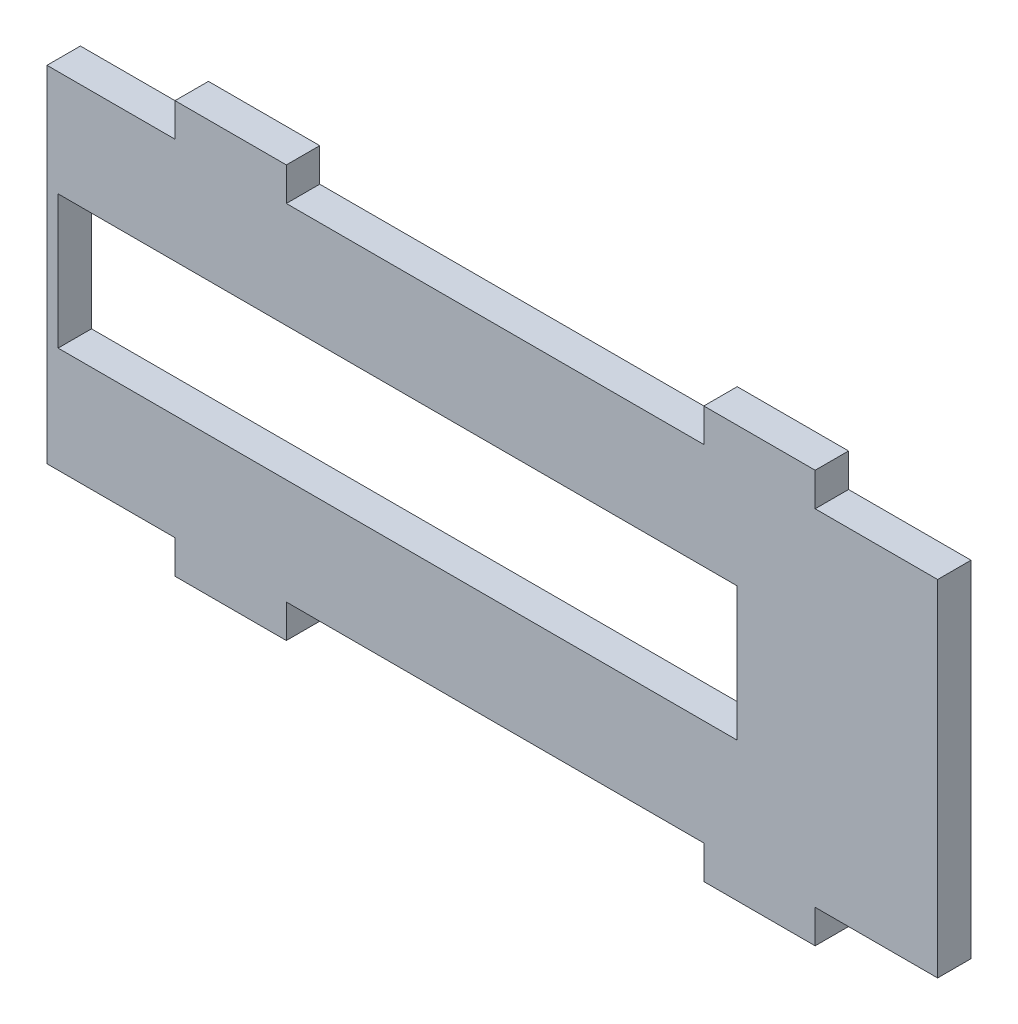
ISO-10303-21;
HEADER;
FILE_DESCRIPTION(('STEP AP214'),'2;1');
FILE_NAME('part.step','',(''),(''),'','','');
FILE_SCHEMA(('AUTOMOTIVE_DESIGN { 1 0 10303 214 1 1 1 1 }'));
ENDSEC;
DATA;
#1=APPLICATION_CONTEXT('core data for automotive mechanical design processes');
#2=APPLICATION_PROTOCOL_DEFINITION('international standard','automotive_design',2000,#1);
#3=PRODUCT_CONTEXT('',#1,'mechanical');
#4=PRODUCT('Part','Part','',(#3));
#5=PRODUCT_RELATED_PRODUCT_CATEGORY('part','',(#4));
#6=PRODUCT_DEFINITION_FORMATION('','',#4);
#7=PRODUCT_DEFINITION_CONTEXT('part definition',#1,'design');
#8=PRODUCT_DEFINITION('design','',#6,#7);
#9=PRODUCT_DEFINITION_SHAPE('','',#8);
#10=(LENGTH_UNIT() NAMED_UNIT(*) SI_UNIT(.MILLI.,.METRE.));
#11=(NAMED_UNIT(*) PLANE_ANGLE_UNIT() SI_UNIT($,.RADIAN.));
#12=(NAMED_UNIT(*) SI_UNIT($,.STERADIAN.) SOLID_ANGLE_UNIT());
#13=UNCERTAINTY_MEASURE_WITH_UNIT(LENGTH_MEASURE(1.E-05),#10,'distance_accuracy_value','');
#14=(GEOMETRIC_REPRESENTATION_CONTEXT(3) GLOBAL_UNCERTAINTY_ASSIGNED_CONTEXT((#13)) GLOBAL_UNIT_ASSIGNED_CONTEXT((#10,
#11,#12)) REPRESENTATION_CONTEXT('',''));
#15=CARTESIAN_POINT('',(0.,0.,0.));
#16=DIRECTION('',(0.,0.,1.));
#17=DIRECTION('',(1.,0.,0.));
#18=AXIS2_PLACEMENT_3D('',#15,#16,#17);
#19=CARTESIAN_POINT('',(0.,0.,3.));
#20=DIRECTION('',(0.,1.,0.));
#21=DIRECTION('',(0.,0.,1.));
#22=AXIS2_PLACEMENT_3D('',#19,#20,#21);
#23=PLANE('',#22);
#24=DIRECTION('',(1.,0.,0.));
#25=VECTOR('',#24,1.);
#26=CARTESIAN_POINT('',(0.,0.,3.));
#27=LINE('',#26,#25);
#28=CARTESIAN_POINT('',(21.5,0.,3.));
#29=VERTEX_POINT('',#28);
#30=CARTESIAN_POINT('',(59.,0.,3.));
#31=VERTEX_POINT('',#30);
#32=EDGE_CURVE('E55',#29,#31,#27,.T.);
#33=ORIENTED_EDGE('',*,*,#32,.F.);
#34=DIRECTION('',(0.,0.,1.));
#35=VECTOR('',#34,1.);
#36=CARTESIAN_POINT('',(21.5,0.,0.));
#37=LINE('',#36,#35);
#38=CARTESIAN_POINT('',(21.5,0.,0.));
#39=VERTEX_POINT('',#38);
#40=EDGE_CURVE('E355',#39,#29,#37,.T.);
#41=ORIENTED_EDGE('',*,*,#40,.F.);
#42=DIRECTION('',(1.,0.,0.));
#43=VECTOR('',#42,1.);
#44=CARTESIAN_POINT('',(0.,0.,0.));
#45=LINE('',#44,#43);
#46=CARTESIAN_POINT('',(59.,0.,0.));
#47=VERTEX_POINT('',#46);
#48=EDGE_CURVE('E223',#39,#47,#45,.T.);
#49=ORIENTED_EDGE('',*,*,#48,.T.);
#50=DIRECTION('',(0.,0.,1.));
#51=VECTOR('',#50,1.);
#52=CARTESIAN_POINT('',(59.,0.,0.));
#53=LINE('',#52,#51);
#54=EDGE_CURVE('E339',#47,#31,#53,.T.);
#55=ORIENTED_EDGE('',*,*,#54,.T.);
#56=EDGE_LOOP('',(#33,#41,#49,#55));
#57=FACE_BOUND('',#56,.T.);
#58=ADVANCED_FACE('F35',(#57),#23,.F.);
#59=DIRECTION('',(0.,0.,1.));
#60=VECTOR('',#59,1.);
#61=CARTESIAN_POINT('',(69.,0.,0.));
#62=LINE('',#61,#60);
#63=CARTESIAN_POINT('',(69.,0.,0.));
#64=VERTEX_POINT('',#63);
#65=CARTESIAN_POINT('',(69.,0.,3.));
#66=VERTEX_POINT('',#65);
#67=EDGE_CURVE('E337',#64,#66,#62,.T.);
#68=ORIENTED_EDGE('',*,*,#67,.F.);
#69=CARTESIAN_POINT('',(80.,0.,0.));
#70=VERTEX_POINT('',#69);
#71=EDGE_CURVE('E225',#64,#70,#45,.T.);
#72=ORIENTED_EDGE('',*,*,#71,.T.);
#73=DIRECTION('',(0.,0.,-1.));
#74=VECTOR('',#73,1.);
#75=CARTESIAN_POINT('',(80.,0.,3.));
#76=LINE('',#75,#74);
#77=CARTESIAN_POINT('',(80.,0.,3.));
#78=VERTEX_POINT('',#77);
#79=EDGE_CURVE('E43',#78,#70,#76,.T.);
#80=ORIENTED_EDGE('',*,*,#79,.F.);
#81=EDGE_CURVE('E252',#66,#78,#27,.T.);
#82=ORIENTED_EDGE('',*,*,#81,.F.);
#83=EDGE_LOOP('',(#68,#72,#80,#82));
#84=FACE_BOUND('',#83,.T.);
#85=ADVANCED_FACE('F387',(#84),#23,.F.);
#86=CARTESIAN_POINT('',(0.,31.,3.));
#87=DIRECTION('',(0.,-1.,0.));
#88=DIRECTION('',(0.,0.,-1.));
#89=AXIS2_PLACEMENT_3D('',#86,#87,#88);
#90=PLANE('',#89);
#91=DIRECTION('',(-1.,0.,0.));
#92=VECTOR('',#91,1.);
#93=CARTESIAN_POINT('',(0.,31.,3.));
#94=LINE('',#93,#92);
#95=CARTESIAN_POINT('',(59.,31.,3.));
#96=VERTEX_POINT('',#95);
#97=CARTESIAN_POINT('',(21.5,31.,3.));
#98=VERTEX_POINT('',#97);
#99=EDGE_CURVE('E246',#96,#98,#94,.T.);
#100=ORIENTED_EDGE('',*,*,#99,.F.);
#101=DIRECTION('',(0.,0.,1.));
#102=VECTOR('',#101,1.);
#103=CARTESIAN_POINT('',(59.,31.,0.));
#104=LINE('',#103,#102);
#105=CARTESIAN_POINT('',(59.,31.,0.));
#106=VERTEX_POINT('',#105);
#107=EDGE_CURVE('E304',#106,#96,#104,.T.);
#108=ORIENTED_EDGE('',*,*,#107,.F.);
#109=DIRECTION('',(-1.,0.,0.));
#110=VECTOR('',#109,1.);
#111=CARTESIAN_POINT('',(0.,31.,0.));
#112=LINE('',#111,#110);
#113=CARTESIAN_POINT('',(21.5,31.,0.));
#114=VERTEX_POINT('',#113);
#115=EDGE_CURVE('E421',#106,#114,#112,.T.);
#116=ORIENTED_EDGE('',*,*,#115,.T.);
#117=DIRECTION('',(0.,0.,1.));
#118=VECTOR('',#117,1.);
#119=CARTESIAN_POINT('',(21.5,31.,0.));
#120=LINE('',#119,#118);
#121=EDGE_CURVE('E287',#114,#98,#120,.T.);
#122=ORIENTED_EDGE('',*,*,#121,.T.);
#123=EDGE_LOOP('',(#100,#108,#116,#122));
#124=FACE_BOUND('',#123,.T.);
#125=ADVANCED_FACE('F419',(#124),#90,.F.);
#126=DIRECTION('',(0.,0.,1.));
#127=VECTOR('',#126,1.);
#128=CARTESIAN_POINT('',(11.5,31.,0.));
#129=LINE('',#128,#127);
#130=CARTESIAN_POINT('',(11.5,31.,0.));
#131=VERTEX_POINT('',#130);
#132=CARTESIAN_POINT('',(11.5,31.,3.));
#133=VERTEX_POINT('',#132);
#134=EDGE_CURVE('E285',#131,#133,#129,.T.);
#135=ORIENTED_EDGE('',*,*,#134,.F.);
#136=CARTESIAN_POINT('',(0.,31.,0.));
#137=VERTEX_POINT('',#136);
#138=EDGE_CURVE('E226',#131,#137,#112,.T.);
#139=ORIENTED_EDGE('',*,*,#138,.T.);
#140=DIRECTION('',(0.,0.,-1.));
#141=VECTOR('',#140,1.);
#142=CARTESIAN_POINT('',(0.,31.,3.));
#143=LINE('',#142,#141);
#144=CARTESIAN_POINT('',(0.,31.,3.));
#145=VERTEX_POINT('',#144);
#146=EDGE_CURVE('E245',#145,#137,#143,.T.);
#147=ORIENTED_EDGE('',*,*,#146,.F.);
#148=EDGE_CURVE('E247',#133,#145,#94,.T.);
#149=ORIENTED_EDGE('',*,*,#148,.F.);
#150=EDGE_LOOP('',(#135,#139,#147,#149));
#151=FACE_BOUND('',#150,.T.);
#152=ADVANCED_FACE('F432',(#151),#90,.F.);
#153=CARTESIAN_POINT('',(0.,0.,3.));
#154=DIRECTION('',(0.,0.,-1.));
#155=DIRECTION('',(-1.,0.,0.));
#156=AXIS2_PLACEMENT_3D('',#153,#154,#155);
#157=PLANE('',#156);
#158=DIRECTION('',(0.,-1.,0.));
#159=VECTOR('',#158,1.);
#160=CARTESIAN_POINT('',(0.,0.,3.));
#161=LINE('',#160,#159);
#162=CARTESIAN_POINT('',(0.,0.,3.));
#163=VERTEX_POINT('',#162);
#164=EDGE_CURVE('E253',#145,#163,#161,.T.);
#165=ORIENTED_EDGE('',*,*,#164,.T.);
#166=CARTESIAN_POINT('',(11.5,0.,3.));
#167=VERTEX_POINT('',#166);
#168=EDGE_CURVE('E250',#163,#167,#27,.T.);
#169=ORIENTED_EDGE('',*,*,#168,.T.);
#170=DIRECTION('',(0.,-1.,0.));
#171=VECTOR('',#170,1.);
#172=CARTESIAN_POINT('',(11.5,0.,3.));
#173=LINE('',#172,#171);
#174=CARTESIAN_POINT('',(11.5,-3.00000000000002,3.));
#175=VERTEX_POINT('',#174);
#176=EDGE_CURVE('E202',#167,#175,#173,.T.);
#177=ORIENTED_EDGE('',*,*,#176,.T.);
#178=DIRECTION('',(1.,0.,0.));
#179=VECTOR('',#178,1.);
#180=CARTESIAN_POINT('',(11.5,-3.00000000000002,3.));
#181=LINE('',#180,#179);
#182=CARTESIAN_POINT('',(21.5,-3.00000000000001,3.));
#183=VERTEX_POINT('',#182);
#184=EDGE_CURVE('E367',#175,#183,#181,.T.);
#185=ORIENTED_EDGE('',*,*,#184,.T.);
#186=DIRECTION('',(0.,1.,0.));
#187=VECTOR('',#186,1.);
#188=CARTESIAN_POINT('',(21.5,0.,3.));
#189=LINE('',#188,#187);
#190=EDGE_CURVE('E50',#183,#29,#189,.T.);
#191=ORIENTED_EDGE('',*,*,#190,.T.);
#192=ORIENTED_EDGE('',*,*,#32,.T.);
#193=DIRECTION('',(0.,-1.,0.));
#194=VECTOR('',#193,1.);
#195=CARTESIAN_POINT('',(59.,0.,3.));
#196=LINE('',#195,#194);
#197=CARTESIAN_POINT('',(59.,-3.00000000000001,3.));
#198=VERTEX_POINT('',#197);
#199=EDGE_CURVE('E350',#31,#198,#196,.T.);
#200=ORIENTED_EDGE('',*,*,#199,.T.);
#201=DIRECTION('',(1.,0.,0.));
#202=VECTOR('',#201,1.);
#203=CARTESIAN_POINT('',(69.,-3.00000000000001,3.));
#204=LINE('',#203,#202);
#205=CARTESIAN_POINT('',(69.,-3.00000000000001,3.));
#206=VERTEX_POINT('',#205);
#207=EDGE_CURVE('E346',#198,#206,#204,.T.);
#208=ORIENTED_EDGE('',*,*,#207,.T.);
#209=DIRECTION('',(0.,1.,0.));
#210=VECTOR('',#209,1.);
#211=CARTESIAN_POINT('',(69.,0.,3.));
#212=LINE('',#211,#210);
#213=EDGE_CURVE('E352',#206,#66,#212,.T.);
#214=ORIENTED_EDGE('',*,*,#213,.T.);
#215=ORIENTED_EDGE('',*,*,#81,.T.);
#216=DIRECTION('',(0.,1.,0.));
#217=VECTOR('',#216,1.);
#218=CARTESIAN_POINT('',(80.,0.,3.));
#219=LINE('',#218,#217);
#220=CARTESIAN_POINT('',(80.,31.,3.));
#221=VERTEX_POINT('',#220);
#222=EDGE_CURVE('E248',#78,#221,#219,.T.);
#223=ORIENTED_EDGE('',*,*,#222,.T.);
#224=CARTESIAN_POINT('',(69.,31.,3.));
#225=VERTEX_POINT('',#224);
#226=EDGE_CURVE('E242',#221,#225,#94,.T.);
#227=ORIENTED_EDGE('',*,*,#226,.T.);
#228=DIRECTION('',(0.,1.,0.));
#229=VECTOR('',#228,1.);
#230=CARTESIAN_POINT('',(69.,31.,3.));
#231=LINE('',#230,#229);
#232=CARTESIAN_POINT('',(69.,34.,3.));
#233=VERTEX_POINT('',#232);
#234=EDGE_CURVE('E327',#225,#233,#231,.T.);
#235=ORIENTED_EDGE('',*,*,#234,.T.);
#236=DIRECTION('',(-1.,0.,0.));
#237=VECTOR('',#236,1.);
#238=CARTESIAN_POINT('',(69.,34.,3.));
#239=LINE('',#238,#237);
#240=CARTESIAN_POINT('',(59.,34.,3.));
#241=VERTEX_POINT('',#240);
#242=EDGE_CURVE('E324',#233,#241,#239,.T.);
#243=ORIENTED_EDGE('',*,*,#242,.T.);
#244=DIRECTION('',(0.,-1.,0.));
#245=VECTOR('',#244,1.);
#246=CARTESIAN_POINT('',(59.,31.,3.));
#247=LINE('',#246,#245);
#248=EDGE_CURVE('E321',#241,#96,#247,.T.);
#249=ORIENTED_EDGE('',*,*,#248,.T.);
#250=ORIENTED_EDGE('',*,*,#99,.T.);
#251=DIRECTION('',(0.,1.,0.));
#252=VECTOR('',#251,1.);
#253=CARTESIAN_POINT('',(21.5,31.,3.));
#254=LINE('',#253,#252);
#255=CARTESIAN_POINT('',(21.5,34.,3.));
#256=VERTEX_POINT('',#255);
#257=EDGE_CURVE('E298',#98,#256,#254,.T.);
#258=ORIENTED_EDGE('',*,*,#257,.T.);
#259=DIRECTION('',(-1.,0.,0.));
#260=VECTOR('',#259,1.);
#261=CARTESIAN_POINT('',(11.5,34.,3.));
#262=LINE('',#261,#260);
#263=CARTESIAN_POINT('',(11.5,34.,3.));
#264=VERTEX_POINT('',#263);
#265=EDGE_CURVE('E294',#256,#264,#262,.T.);
#266=ORIENTED_EDGE('',*,*,#265,.T.);
#267=DIRECTION('',(0.,-1.,0.));
#268=VECTOR('',#267,1.);
#269=CARTESIAN_POINT('',(11.5,31.,3.));
#270=LINE('',#269,#268);
#271=EDGE_CURVE('E301',#264,#133,#270,.T.);
#272=ORIENTED_EDGE('',*,*,#271,.T.);
#273=ORIENTED_EDGE('',*,*,#148,.T.);
#274=EDGE_LOOP('',(#165,#169,#177,#185,#191,#192,#200,#208,#214,#215,#223,#227,#235,#243,#249,
#250,#258,#266,#272,#273));
#275=FACE_BOUND('',#274,.T.);
#276=DIRECTION('',(0.,-1.,0.));
#277=VECTOR('',#276,1.);
#278=CARTESIAN_POINT('',(0.999999999999999,21.5,3.));
#279=LINE('',#278,#277);
#280=CARTESIAN_POINT('',(0.999999999999999,21.5,3.));
#281=VERTEX_POINT('',#280);
#282=CARTESIAN_POINT('',(0.999999999999999,9.5,3.));
#283=VERTEX_POINT('',#282);
#284=EDGE_CURVE('E267',#281,#283,#279,.T.);
#285=ORIENTED_EDGE('',*,*,#284,.F.);
#286=DIRECTION('',(-1.,0.,0.));
#287=VECTOR('',#286,1.);
#288=CARTESIAN_POINT('',(0.999999999999999,21.5,3.));
#289=LINE('',#288,#287);
#290=CARTESIAN_POINT('',(62.,21.5,3.));
#291=VERTEX_POINT('',#290);
#292=EDGE_CURVE('E263',#291,#281,#289,.T.);
#293=ORIENTED_EDGE('',*,*,#292,.F.);
#294=DIRECTION('',(0.,1.,0.));
#295=VECTOR('',#294,1.);
#296=CARTESIAN_POINT('',(62.,21.5,3.));
#297=LINE('',#296,#295);
#298=CARTESIAN_POINT('',(62.,9.5,3.));
#299=VERTEX_POINT('',#298);
#300=EDGE_CURVE('E279',#299,#291,#297,.T.);
#301=ORIENTED_EDGE('',*,*,#300,.F.);
#302=DIRECTION('',(1.,0.,0.));
#303=VECTOR('',#302,1.);
#304=CARTESIAN_POINT('',(0.999999999999999,9.5,3.));
#305=LINE('',#304,#303);
#306=EDGE_CURVE('E282',#283,#299,#305,.T.);
#307=ORIENTED_EDGE('',*,*,#306,.F.);
#308=EDGE_LOOP('',(#285,#293,#301,#307));
#309=FACE_BOUND('',#308,.T.);
#310=ADVANCED_FACE('F382',(#275,#309),#157,.F.);
#311=CARTESIAN_POINT('',(0.,0.,0.));
#312=DIRECTION('',(0.,0.,-1.));
#313=DIRECTION('',(-1.,0.,0.));
#314=AXIS2_PLACEMENT_3D('',#311,#312,#313);
#315=PLANE('',#314);
#316=DIRECTION('',(0.,-1.,0.));
#317=VECTOR('',#316,1.);
#318=CARTESIAN_POINT('',(0.,0.,0.));
#319=LINE('',#318,#317);
#320=CARTESIAN_POINT('',(0.,0.,0.));
#321=VERTEX_POINT('',#320);
#322=EDGE_CURVE('E229',#137,#321,#319,.T.);
#323=ORIENTED_EDGE('',*,*,#322,.F.);
#324=ORIENTED_EDGE('',*,*,#138,.F.);
#325=DIRECTION('',(0.,-1.,0.));
#326=VECTOR('',#325,1.);
#327=CARTESIAN_POINT('',(11.5,31.,0.));
#328=LINE('',#327,#326);
#329=CARTESIAN_POINT('',(11.5,34.,0.));
#330=VERTEX_POINT('',#329);
#331=EDGE_CURVE('E297',#330,#131,#328,.T.);
#332=ORIENTED_EDGE('',*,*,#331,.F.);
#333=DIRECTION('',(-1.,0.,0.));
#334=VECTOR('',#333,1.);
#335=CARTESIAN_POINT('',(11.5,34.,0.));
#336=LINE('',#335,#334);
#337=CARTESIAN_POINT('',(21.5,34.,0.));
#338=VERTEX_POINT('',#337);
#339=EDGE_CURVE('E288',#338,#330,#336,.T.);
#340=ORIENTED_EDGE('',*,*,#339,.F.);
#341=DIRECTION('',(0.,1.,0.));
#342=VECTOR('',#341,1.);
#343=CARTESIAN_POINT('',(21.5,31.,0.));
#344=LINE('',#343,#342);
#345=EDGE_CURVE('E307',#114,#338,#344,.T.);
#346=ORIENTED_EDGE('',*,*,#345,.F.);
#347=ORIENTED_EDGE('',*,*,#115,.F.);
#348=DIRECTION('',(0.,-1.,0.));
#349=VECTOR('',#348,1.);
#350=CARTESIAN_POINT('',(59.,31.,0.));
#351=LINE('',#350,#349);
#352=CARTESIAN_POINT('',(59.,34.,0.));
#353=VERTEX_POINT('',#352);
#354=EDGE_CURVE('E315',#353,#106,#351,.T.);
#355=ORIENTED_EDGE('',*,*,#354,.F.);
#356=DIRECTION('',(-1.,0.,0.));
#357=VECTOR('',#356,1.);
#358=CARTESIAN_POINT('',(69.,34.,0.));
#359=LINE('',#358,#357);
#360=CARTESIAN_POINT('',(69.,34.,0.));
#361=VERTEX_POINT('',#360);
#362=EDGE_CURVE('E332',#361,#353,#359,.T.);
#363=ORIENTED_EDGE('',*,*,#362,.F.);
#364=DIRECTION('',(0.,1.,0.));
#365=VECTOR('',#364,1.);
#366=CARTESIAN_POINT('',(69.,31.,0.));
#367=LINE('',#366,#365);
#368=CARTESIAN_POINT('',(69.,31.,0.));
#369=VERTEX_POINT('',#368);
#370=EDGE_CURVE('E323',#369,#361,#367,.T.);
#371=ORIENTED_EDGE('',*,*,#370,.F.);
#372=CARTESIAN_POINT('',(80.,31.,0.));
#373=VERTEX_POINT('',#372);
#374=EDGE_CURVE('E255',#373,#369,#112,.T.);
#375=ORIENTED_EDGE('',*,*,#374,.F.);
#376=DIRECTION('',(0.,1.,0.));
#377=VECTOR('',#376,1.);
#378=CARTESIAN_POINT('',(80.,0.,0.));
#379=LINE('',#378,#377);
#380=EDGE_CURVE('E222',#70,#373,#379,.T.);
#381=ORIENTED_EDGE('',*,*,#380,.F.);
#382=ORIENTED_EDGE('',*,*,#71,.F.);
#383=DIRECTION('',(0.,1.,0.));
#384=VECTOR('',#383,1.);
#385=CARTESIAN_POINT('',(69.,0.,0.));
#386=LINE('',#385,#384);
#387=CARTESIAN_POINT('',(69.,-3.00000000000001,0.));
#388=VERTEX_POINT('',#387);
#389=EDGE_CURVE('E349',#388,#64,#386,.T.);
#390=ORIENTED_EDGE('',*,*,#389,.F.);
#391=DIRECTION('',(1.,0.,0.));
#392=VECTOR('',#391,1.);
#393=CARTESIAN_POINT('',(69.,-3.00000000000001,0.));
#394=LINE('',#393,#392);
#395=CARTESIAN_POINT('',(59.,-3.00000000000001,0.));
#396=VERTEX_POINT('',#395);
#397=EDGE_CURVE('E340',#396,#388,#394,.T.);
#398=ORIENTED_EDGE('',*,*,#397,.F.);
#399=DIRECTION('',(0.,-1.,0.));
#400=VECTOR('',#399,1.);
#401=CARTESIAN_POINT('',(59.,0.,0.));
#402=LINE('',#401,#400);
#403=EDGE_CURVE('E358',#47,#396,#402,.T.);
#404=ORIENTED_EDGE('',*,*,#403,.F.);
#405=ORIENTED_EDGE('',*,*,#48,.F.);
#406=DIRECTION('',(0.,1.,0.));
#407=VECTOR('',#406,1.);
#408=CARTESIAN_POINT('',(21.5,0.,0.));
#409=LINE('',#408,#407);
#410=CARTESIAN_POINT('',(21.5,-3.00000000000001,0.));
#411=VERTEX_POINT('',#410);
#412=EDGE_CURVE('E207',#411,#39,#409,.T.);
#413=ORIENTED_EDGE('',*,*,#412,.F.);
#414=DIRECTION('',(1.,0.,0.));
#415=VECTOR('',#414,1.);
#416=CARTESIAN_POINT('',(11.5,-3.00000000000002,0.));
#417=LINE('',#416,#415);
#418=CARTESIAN_POINT('',(11.5,-3.00000000000002,0.));
#419=VERTEX_POINT('',#418);
#420=EDGE_CURVE('E217',#419,#411,#417,.T.);
#421=ORIENTED_EDGE('',*,*,#420,.F.);
#422=DIRECTION('',(0.,-1.,0.));
#423=VECTOR('',#422,1.);
#424=CARTESIAN_POINT('',(11.5,0.,0.));
#425=LINE('',#424,#423);
#426=CARTESIAN_POINT('',(11.5,0.,0.));
#427=VERTEX_POINT('',#426);
#428=EDGE_CURVE('E200',#427,#419,#425,.T.);
#429=ORIENTED_EDGE('',*,*,#428,.F.);
#430=EDGE_CURVE('E214',#321,#427,#45,.T.);
#431=ORIENTED_EDGE('',*,*,#430,.F.);
#432=EDGE_LOOP('',(#323,#324,#332,#340,#346,#347,#355,#363,#371,#375,#381,#382,#390,#398,#404,
#405,#413,#421,#429,#431));
#433=FACE_BOUND('',#432,.T.);
#434=DIRECTION('',(-1.,0.,0.));
#435=VECTOR('',#434,1.);
#436=CARTESIAN_POINT('',(0.999999999999999,21.5,0.));
#437=LINE('',#436,#435);
#438=CARTESIAN_POINT('',(62.,21.5,0.));
#439=VERTEX_POINT('',#438);
#440=CARTESIAN_POINT('',(0.999999999999999,21.5,0.));
#441=VERTEX_POINT('',#440);
#442=EDGE_CURVE('E264',#439,#441,#437,.T.);
#443=ORIENTED_EDGE('',*,*,#442,.T.);
#444=DIRECTION('',(0.,-1.,0.));
#445=VECTOR('',#444,1.);
#446=CARTESIAN_POINT('',(0.999999999999999,21.5,0.));
#447=LINE('',#446,#445);
#448=CARTESIAN_POINT('',(0.999999999999999,9.5,0.));
#449=VERTEX_POINT('',#448);
#450=EDGE_CURVE('E274',#441,#449,#447,.T.);
#451=ORIENTED_EDGE('',*,*,#450,.T.);
#452=DIRECTION('',(1.,0.,0.));
#453=VECTOR('',#452,1.);
#454=CARTESIAN_POINT('',(0.999999999999999,9.5,0.));
#455=LINE('',#454,#453);
#456=CARTESIAN_POINT('',(62.,9.5,0.));
#457=VERTEX_POINT('',#456);
#458=EDGE_CURVE('E271',#449,#457,#455,.T.);
#459=ORIENTED_EDGE('',*,*,#458,.T.);
#460=DIRECTION('',(0.,1.,0.));
#461=VECTOR('',#460,1.);
#462=CARTESIAN_POINT('',(62.,21.5,0.));
#463=LINE('',#462,#461);
#464=EDGE_CURVE('E268',#457,#439,#463,.T.);
#465=ORIENTED_EDGE('',*,*,#464,.T.);
#466=EDGE_LOOP('',(#443,#451,#459,#465));
#467=FACE_BOUND('',#466,.T.);
#468=ADVANCED_FACE('F212',(#433,#467),#315,.T.);
#469=CARTESIAN_POINT('',(0.,0.,3.));
#470=DIRECTION('',(1.,0.,0.));
#471=DIRECTION('',(0.,0.,-1.));
#472=AXIS2_PLACEMENT_3D('',#469,#470,#471);
#473=PLANE('',#472);
#474=ORIENTED_EDGE('',*,*,#322,.T.);
#475=DIRECTION('',(0.,0.,-1.));
#476=VECTOR('',#475,1.);
#477=CARTESIAN_POINT('',(0.,0.,3.));
#478=LINE('',#477,#476);
#479=EDGE_CURVE('E11',#163,#321,#478,.T.);
#480=ORIENTED_EDGE('',*,*,#479,.F.);
#481=ORIENTED_EDGE('',*,*,#164,.F.);
#482=ORIENTED_EDGE('',*,*,#146,.T.);
#483=EDGE_LOOP('',(#474,#480,#481,#482));
#484=FACE_BOUND('',#483,.T.);
#485=ADVANCED_FACE('F37',(#484),#473,.F.);
#486=ORIENTED_EDGE('',*,*,#430,.T.);
#487=DIRECTION('',(0.,0.,1.));
#488=VECTOR('',#487,1.);
#489=CARTESIAN_POINT('',(11.5,0.,0.));
#490=LINE('',#489,#488);
#491=EDGE_CURVE('E197',#427,#167,#490,.T.);
#492=ORIENTED_EDGE('',*,*,#491,.T.);
#493=ORIENTED_EDGE('',*,*,#168,.F.);
#494=ORIENTED_EDGE('',*,*,#479,.T.);
#495=EDGE_LOOP('',(#486,#492,#493,#494));
#496=FACE_BOUND('',#495,.T.);
#497=ADVANCED_FACE('F219',(#496),#23,.F.);
#498=CARTESIAN_POINT('',(80.,0.,3.));
#499=DIRECTION('',(-1.,0.,0.));
#500=DIRECTION('',(0.,0.,1.));
#501=AXIS2_PLACEMENT_3D('',#498,#499,#500);
#502=PLANE('',#501);
#503=ORIENTED_EDGE('',*,*,#380,.T.);
#504=DIRECTION('',(0.,0.,-1.));
#505=VECTOR('',#504,1.);
#506=CARTESIAN_POINT('',(80.,31.,3.));
#507=LINE('',#506,#505);
#508=EDGE_CURVE('E390',#221,#373,#507,.T.);
#509=ORIENTED_EDGE('',*,*,#508,.F.);
#510=ORIENTED_EDGE('',*,*,#222,.F.);
#511=ORIENTED_EDGE('',*,*,#79,.T.);
#512=EDGE_LOOP('',(#503,#509,#510,#511));
#513=FACE_BOUND('',#512,.T.);
#514=ADVANCED_FACE('F391',(#513),#502,.F.);
#515=ORIENTED_EDGE('',*,*,#374,.T.);
#516=DIRECTION('',(0.,0.,1.));
#517=VECTOR('',#516,1.);
#518=CARTESIAN_POINT('',(69.,31.,0.));
#519=LINE('',#518,#517);
#520=EDGE_CURVE('E311',#369,#225,#519,.T.);
#521=ORIENTED_EDGE('',*,*,#520,.T.);
#522=ORIENTED_EDGE('',*,*,#226,.F.);
#523=ORIENTED_EDGE('',*,*,#508,.T.);
#524=EDGE_LOOP('',(#515,#521,#522,#523));
#525=FACE_BOUND('',#524,.T.);
#526=ADVANCED_FACE('F398',(#525),#90,.F.);
#527=CARTESIAN_POINT('',(0.999999999999999,21.5,3.));
#528=DIRECTION('',(1.,0.,0.));
#529=DIRECTION('',(0.,0.,-1.));
#530=AXIS2_PLACEMENT_3D('',#527,#528,#529);
#531=PLANE('',#530);
#532=ORIENTED_EDGE('',*,*,#450,.F.);
#533=DIRECTION('',(0.,0.,-1.));
#534=VECTOR('',#533,1.);
#535=CARTESIAN_POINT('',(0.999999999999999,21.5,3.));
#536=LINE('',#535,#534);
#537=EDGE_CURVE('E260',#281,#441,#536,.T.);
#538=ORIENTED_EDGE('',*,*,#537,.F.);
#539=ORIENTED_EDGE('',*,*,#284,.T.);
#540=DIRECTION('',(0.,0.,-1.));
#541=VECTOR('',#540,1.);
#542=CARTESIAN_POINT('',(0.999999999999999,9.5,3.));
#543=LINE('',#542,#541);
#544=EDGE_CURVE('E235',#283,#449,#543,.T.);
#545=ORIENTED_EDGE('',*,*,#544,.T.);
#546=EDGE_LOOP('',(#532,#538,#539,#545));
#547=FACE_BOUND('',#546,.T.);
#548=ADVANCED_FACE('F469',(#547),#531,.T.);
#549=CARTESIAN_POINT('',(0.999999999999999,9.5,3.));
#550=DIRECTION('',(0.,1.,0.));
#551=DIRECTION('',(0.,0.,1.));
#552=AXIS2_PLACEMENT_3D('',#549,#550,#551);
#553=PLANE('',#552);
#554=ORIENTED_EDGE('',*,*,#458,.F.);
#555=ORIENTED_EDGE('',*,*,#544,.F.);
#556=ORIENTED_EDGE('',*,*,#306,.T.);
#557=DIRECTION('',(0.,0.,-1.));
#558=VECTOR('',#557,1.);
#559=CARTESIAN_POINT('',(62.,9.5,3.));
#560=LINE('',#559,#558);
#561=EDGE_CURVE('E239',#299,#457,#560,.T.);
#562=ORIENTED_EDGE('',*,*,#561,.T.);
#563=EDGE_LOOP('',(#554,#555,#556,#562));
#564=FACE_BOUND('',#563,.T.);
#565=ADVANCED_FACE('F473',(#564),#553,.T.);
#566=CARTESIAN_POINT('',(62.,21.5,3.));
#567=DIRECTION('',(-1.,0.,0.));
#568=DIRECTION('',(0.,0.,1.));
#569=AXIS2_PLACEMENT_3D('',#566,#567,#568);
#570=PLANE('',#569);
#571=ORIENTED_EDGE('',*,*,#464,.F.);
#572=ORIENTED_EDGE('',*,*,#561,.F.);
#573=ORIENTED_EDGE('',*,*,#300,.T.);
#574=DIRECTION('',(0.,0.,-1.));
#575=VECTOR('',#574,1.);
#576=CARTESIAN_POINT('',(62.,21.5,3.));
#577=LINE('',#576,#575);
#578=EDGE_CURVE('E258',#291,#439,#577,.T.);
#579=ORIENTED_EDGE('',*,*,#578,.T.);
#580=EDGE_LOOP('',(#571,#572,#573,#579));
#581=FACE_BOUND('',#580,.T.);
#582=ADVANCED_FACE('F607',(#581),#570,.T.);
#583=CARTESIAN_POINT('',(0.999999999999999,21.5,3.));
#584=DIRECTION('',(0.,-1.,0.));
#585=DIRECTION('',(0.,0.,-1.));
#586=AXIS2_PLACEMENT_3D('',#583,#584,#585);
#587=PLANE('',#586);
#588=ORIENTED_EDGE('',*,*,#442,.F.);
#589=ORIENTED_EDGE('',*,*,#578,.F.);
#590=ORIENTED_EDGE('',*,*,#292,.T.);
#591=ORIENTED_EDGE('',*,*,#537,.T.);
#592=EDGE_LOOP('',(#588,#589,#590,#591));
#593=FACE_BOUND('',#592,.T.);
#594=ADVANCED_FACE('F445',(#593),#587,.T.);
#595=CARTESIAN_POINT('',(11.5,31.,0.));
#596=DIRECTION('',(-1.,0.,0.));
#597=DIRECTION('',(0.,-1.,0.));
#598=AXIS2_PLACEMENT_3D('',#595,#596,#597);
#599=PLANE('',#598);
#600=ORIENTED_EDGE('',*,*,#271,.F.);
#601=DIRECTION('',(0.,0.,1.));
#602=VECTOR('',#601,1.);
#603=CARTESIAN_POINT('',(11.5,34.,0.));
#604=LINE('',#603,#602);
#605=EDGE_CURVE('E277',#330,#264,#604,.T.);
#606=ORIENTED_EDGE('',*,*,#605,.F.);
#607=ORIENTED_EDGE('',*,*,#331,.T.);
#608=ORIENTED_EDGE('',*,*,#134,.T.);
#609=EDGE_LOOP('',(#600,#606,#607,#608));
#610=FACE_BOUND('',#609,.T.);
#611=ADVANCED_FACE('F435',(#610),#599,.T.);
#612=CARTESIAN_POINT('',(11.5,34.,0.));
#613=DIRECTION('',(0.,1.,0.));
#614=DIRECTION('',(0.,0.,1.));
#615=AXIS2_PLACEMENT_3D('',#612,#613,#614);
#616=PLANE('',#615);
#617=ORIENTED_EDGE('',*,*,#265,.F.);
#618=DIRECTION('',(0.,0.,1.));
#619=VECTOR('',#618,1.);
#620=CARTESIAN_POINT('',(21.5,34.,0.));
#621=LINE('',#620,#619);
#622=EDGE_CURVE('E291',#338,#256,#621,.T.);
#623=ORIENTED_EDGE('',*,*,#622,.F.);
#624=ORIENTED_EDGE('',*,*,#339,.T.);
#625=ORIENTED_EDGE('',*,*,#605,.T.);
#626=EDGE_LOOP('',(#617,#623,#624,#625));
#627=FACE_BOUND('',#626,.T.);
#628=ADVANCED_FACE('F437',(#627),#616,.T.);
#629=CARTESIAN_POINT('',(21.5,31.,0.));
#630=DIRECTION('',(1.,0.,0.));
#631=DIRECTION('',(0.,0.,-1.));
#632=AXIS2_PLACEMENT_3D('',#629,#630,#631);
#633=PLANE('',#632);
#634=ORIENTED_EDGE('',*,*,#257,.F.);
#635=ORIENTED_EDGE('',*,*,#121,.F.);
#636=ORIENTED_EDGE('',*,*,#345,.T.);
#637=ORIENTED_EDGE('',*,*,#622,.T.);
#638=EDGE_LOOP('',(#634,#635,#636,#637));
#639=FACE_BOUND('',#638,.T.);
#640=ADVANCED_FACE('F417',(#639),#633,.T.);
#641=CARTESIAN_POINT('',(59.,31.,0.));
#642=DIRECTION('',(-1.,0.,0.));
#643=DIRECTION('',(0.,0.,1.));
#644=AXIS2_PLACEMENT_3D('',#641,#642,#643);
#645=PLANE('',#644);
#646=ORIENTED_EDGE('',*,*,#248,.F.);
#647=DIRECTION('',(0.,0.,1.));
#648=VECTOR('',#647,1.);
#649=CARTESIAN_POINT('',(59.,34.,0.));
#650=LINE('',#649,#648);
#651=EDGE_CURVE('E317',#353,#241,#650,.T.);
#652=ORIENTED_EDGE('',*,*,#651,.F.);
#653=ORIENTED_EDGE('',*,*,#354,.T.);
#654=ORIENTED_EDGE('',*,*,#107,.T.);
#655=EDGE_LOOP('',(#646,#652,#653,#654));
#656=FACE_BOUND('',#655,.T.);
#657=ADVANCED_FACE('F409',(#656),#645,.T.);
#658=CARTESIAN_POINT('',(69.,34.,0.));
#659=DIRECTION('',(0.,1.,0.));
#660=DIRECTION('',(0.,0.,1.));
#661=AXIS2_PLACEMENT_3D('',#658,#659,#660);
#662=PLANE('',#661);
#663=ORIENTED_EDGE('',*,*,#242,.F.);
#664=DIRECTION('',(0.,0.,1.));
#665=VECTOR('',#664,1.);
#666=CARTESIAN_POINT('',(69.,34.,0.));
#667=LINE('',#666,#665);
#668=EDGE_CURVE('E314',#361,#233,#667,.T.);
#669=ORIENTED_EDGE('',*,*,#668,.F.);
#670=ORIENTED_EDGE('',*,*,#362,.T.);
#671=ORIENTED_EDGE('',*,*,#651,.T.);
#672=EDGE_LOOP('',(#663,#669,#670,#671));
#673=FACE_BOUND('',#672,.T.);
#674=ADVANCED_FACE('F406',(#673),#662,.T.);
#675=CARTESIAN_POINT('',(69.,31.,0.));
#676=DIRECTION('',(1.,0.,0.));
#677=DIRECTION('',(0.,1.,0.));
#678=AXIS2_PLACEMENT_3D('',#675,#676,#677);
#679=PLANE('',#678);
#680=ORIENTED_EDGE('',*,*,#234,.F.);
#681=ORIENTED_EDGE('',*,*,#520,.F.);
#682=ORIENTED_EDGE('',*,*,#370,.T.);
#683=ORIENTED_EDGE('',*,*,#668,.T.);
#684=EDGE_LOOP('',(#680,#681,#682,#683));
#685=FACE_BOUND('',#684,.T.);
#686=ADVANCED_FACE('F402',(#685),#679,.T.);
#687=CARTESIAN_POINT('',(69.,0.,0.));
#688=DIRECTION('',(1.,0.,0.));
#689=DIRECTION('',(0.,1.,0.));
#690=AXIS2_PLACEMENT_3D('',#687,#688,#689);
#691=PLANE('',#690);
#692=ORIENTED_EDGE('',*,*,#213,.F.);
#693=DIRECTION('',(0.,0.,1.));
#694=VECTOR('',#693,1.);
#695=CARTESIAN_POINT('',(69.,-3.00000000000001,0.));
#696=LINE('',#695,#694);
#697=EDGE_CURVE('E330',#388,#206,#696,.T.);
#698=ORIENTED_EDGE('',*,*,#697,.F.);
#699=ORIENTED_EDGE('',*,*,#389,.T.);
#700=ORIENTED_EDGE('',*,*,#67,.T.);
#701=EDGE_LOOP('',(#692,#698,#699,#700));
#702=FACE_BOUND('',#701,.T.);
#703=ADVANCED_FACE('F545',(#702),#691,.T.);
#704=CARTESIAN_POINT('',(69.,-3.00000000000001,0.));
#705=DIRECTION('',(0.,-1.,0.));
#706=DIRECTION('',(0.,0.,-1.));
#707=AXIS2_PLACEMENT_3D('',#704,#705,#706);
#708=PLANE('',#707);
#709=ORIENTED_EDGE('',*,*,#207,.F.);
#710=DIRECTION('',(0.,0.,1.));
#711=VECTOR('',#710,1.);
#712=CARTESIAN_POINT('',(59.,-3.00000000000001,0.));
#713=LINE('',#712,#711);
#714=EDGE_CURVE('E343',#396,#198,#713,.T.);
#715=ORIENTED_EDGE('',*,*,#714,.F.);
#716=ORIENTED_EDGE('',*,*,#397,.T.);
#717=ORIENTED_EDGE('',*,*,#697,.T.);
#718=EDGE_LOOP('',(#709,#715,#716,#717));
#719=FACE_BOUND('',#718,.T.);
#720=ADVANCED_FACE('F553',(#719),#708,.T.);
#721=CARTESIAN_POINT('',(59.,0.,0.));
#722=DIRECTION('',(-1.,0.,0.));
#723=DIRECTION('',(0.,0.,1.));
#724=AXIS2_PLACEMENT_3D('',#721,#722,#723);
#725=PLANE('',#724);
#726=ORIENTED_EDGE('',*,*,#199,.F.);
#727=ORIENTED_EDGE('',*,*,#54,.F.);
#728=ORIENTED_EDGE('',*,*,#403,.T.);
#729=ORIENTED_EDGE('',*,*,#714,.T.);
#730=EDGE_LOOP('',(#726,#727,#728,#729));
#731=FACE_BOUND('',#730,.T.);
#732=ADVANCED_FACE('F563',(#731),#725,.T.);
#733=CARTESIAN_POINT('',(21.5,0.,0.));
#734=DIRECTION('',(1.,0.,0.));
#735=DIRECTION('',(0.,0.,-1.));
#736=AXIS2_PLACEMENT_3D('',#733,#734,#735);
#737=PLANE('',#736);
#738=ORIENTED_EDGE('',*,*,#190,.F.);
#739=DIRECTION('',(0.,0.,1.));
#740=VECTOR('',#739,1.);
#741=CARTESIAN_POINT('',(21.5,-3.00000000000001,0.));
#742=LINE('',#741,#740);
#743=EDGE_CURVE('E363',#411,#183,#742,.T.);
#744=ORIENTED_EDGE('',*,*,#743,.F.);
#745=ORIENTED_EDGE('',*,*,#412,.T.);
#746=ORIENTED_EDGE('',*,*,#40,.T.);
#747=EDGE_LOOP('',(#738,#744,#745,#746));
#748=FACE_BOUND('',#747,.T.);
#749=ADVANCED_FACE('F378',(#748),#737,.T.);
#750=CARTESIAN_POINT('',(11.5,-3.00000000000002,0.));
#751=DIRECTION('',(0.,-1.,0.));
#752=DIRECTION('',(1.,0.,0.));
#753=AXIS2_PLACEMENT_3D('',#750,#751,#752);
#754=PLANE('',#753);
#755=ORIENTED_EDGE('',*,*,#184,.F.);
#756=DIRECTION('',(0.,0.,1.));
#757=VECTOR('',#756,1.);
#758=CARTESIAN_POINT('',(11.5,-3.00000000000002,0.));
#759=LINE('',#758,#757);
#760=EDGE_CURVE('E206',#419,#175,#759,.T.);
#761=ORIENTED_EDGE('',*,*,#760,.F.);
#762=ORIENTED_EDGE('',*,*,#420,.T.);
#763=ORIENTED_EDGE('',*,*,#743,.T.);
#764=EDGE_LOOP('',(#755,#761,#762,#763));
#765=FACE_BOUND('',#764,.T.);
#766=ADVANCED_FACE('F373',(#765),#754,.T.);
#767=CARTESIAN_POINT('',(11.5,0.,0.));
#768=DIRECTION('',(-1.,0.,0.));
#769=DIRECTION('',(0.,-1.,0.));
#770=AXIS2_PLACEMENT_3D('',#767,#768,#769);
#771=PLANE('',#770);
#772=ORIENTED_EDGE('',*,*,#176,.F.);
#773=ORIENTED_EDGE('',*,*,#491,.F.);
#774=ORIENTED_EDGE('',*,*,#428,.T.);
#775=ORIENTED_EDGE('',*,*,#760,.T.);
#776=EDGE_LOOP('',(#772,#773,#774,#775));
#777=FACE_BOUND('',#776,.T.);
#778=ADVANCED_FACE('F199',(#777),#771,.T.);
#779=CLOSED_SHELL('',(#58,#85,#125,#152,#310,#468,#485,#497,#514,#526,#548,#565,#582,#594,#611,
#628,#640,#657,#674,#686,#703,#720,#732,#749,#766,#778));
#780=MANIFOLD_SOLID_BREP('B2',#779);
#781=ADVANCED_BREP_SHAPE_REPRESENTATION('',(#18,#780),#14);
#782=SHAPE_DEFINITION_REPRESENTATION(#9,#781);
ENDSEC;
END-ISO-10303-21;
